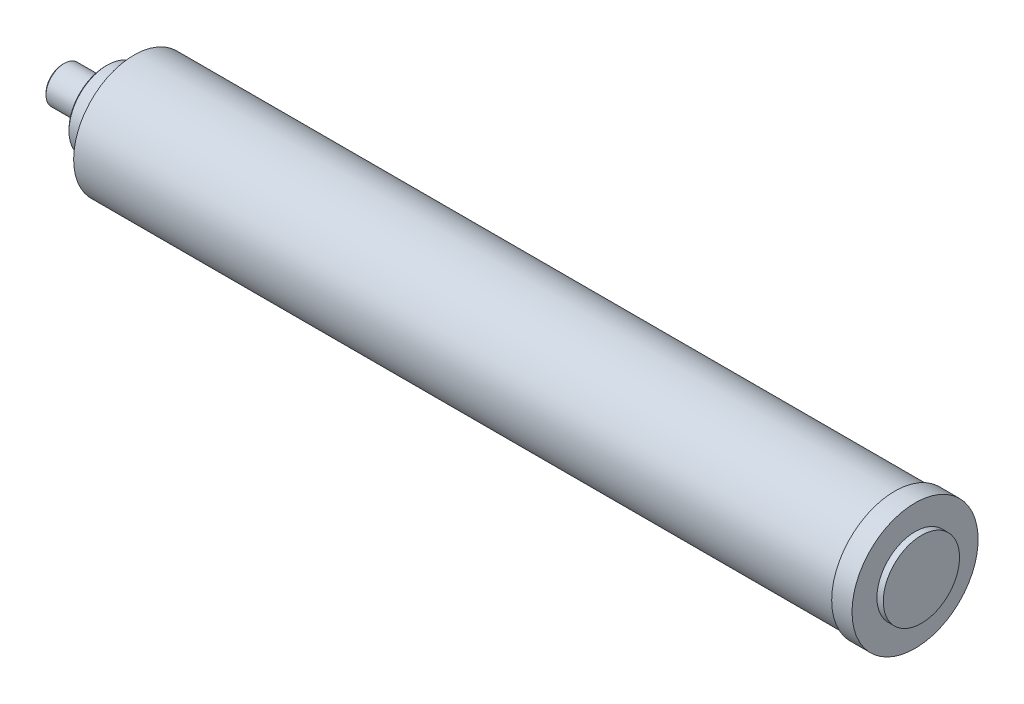
ISO-10303-21;
HEADER;
FILE_DESCRIPTION(('STEP AP214'),'2;1');
FILE_NAME('part.step','',(''),(''),'','','');
FILE_SCHEMA(('AUTOMOTIVE_DESIGN { 1 0 10303 214 1 1 1 1 }'));
ENDSEC;
DATA;
#1=APPLICATION_CONTEXT('core data for automotive mechanical design processes');
#2=APPLICATION_PROTOCOL_DEFINITION('international standard','automotive_design',2000,#1);
#3=PRODUCT_CONTEXT('',#1,'mechanical');
#4=PRODUCT('Part','Part','',(#3));
#5=PRODUCT_RELATED_PRODUCT_CATEGORY('part','',(#4));
#6=PRODUCT_DEFINITION_FORMATION('','',#4);
#7=PRODUCT_DEFINITION_CONTEXT('part definition',#1,'design');
#8=PRODUCT_DEFINITION('design','',#6,#7);
#9=PRODUCT_DEFINITION_SHAPE('','',#8);
#10=(LENGTH_UNIT() NAMED_UNIT(*) SI_UNIT(.MILLI.,.METRE.));
#11=(NAMED_UNIT(*) PLANE_ANGLE_UNIT() SI_UNIT($,.RADIAN.));
#12=(NAMED_UNIT(*) SI_UNIT($,.STERADIAN.) SOLID_ANGLE_UNIT());
#13=UNCERTAINTY_MEASURE_WITH_UNIT(LENGTH_MEASURE(1.E-05),#10,'distance_accuracy_value','');
#14=(GEOMETRIC_REPRESENTATION_CONTEXT(3) GLOBAL_UNCERTAINTY_ASSIGNED_CONTEXT((#13)) GLOBAL_UNIT_ASSIGNED_CONTEXT((#10,
#11,#12)) REPRESENTATION_CONTEXT('',''));
#15=CARTESIAN_POINT('',(0.,0.,0.));
#16=DIRECTION('',(0.,0.,1.));
#17=DIRECTION('',(1.,0.,0.));
#18=AXIS2_PLACEMENT_3D('',#15,#16,#17);
#19=CARTESIAN_POINT('',(0.,0.,0.));
#20=DIRECTION('',(1.,0.,0.));
#21=DIRECTION('',(0.,0.,-1.));
#22=AXIS2_PLACEMENT_3D('',#19,#20,#21);
#23=PLANE('',#22);
#24=CARTESIAN_POINT('',(0.,0.,0.));
#25=DIRECTION('',(1.,0.,0.));
#26=DIRECTION('',(0.,0.,-1.));
#27=AXIS2_PLACEMENT_3D('',#24,#25,#26);
#28=CIRCLE('',#27,10.395);
#29=CARTESIAN_POINT('',(0.,0.,-10.395));
#30=VERTEX_POINT('',#29);
#31=EDGE_CURVE('E52',#30,#30,#28,.F.);
#32=ORIENTED_EDGE('',*,*,#31,.T.);
#33=EDGE_LOOP('',(#32));
#34=FACE_BOUND('',#33,.T.);
#35=ADVANCED_FACE('F45',(#34),#23,.F.);
#36=CARTESIAN_POINT('',(0.,0.,0.));
#37=DIRECTION('',(-1.,0.,0.));
#38=DIRECTION('',(0.,0.,1.));
#39=AXIS2_PLACEMENT_3D('',#36,#37,#38);
#40=CYLINDRICAL_SURFACE('',#39,11.3949999999999);
#41=CARTESIAN_POINT('',(0.999999999999931,0.,0.));
#42=DIRECTION('',(1.,0.,0.));
#43=DIRECTION('',(0.,0.,-1.));
#44=AXIS2_PLACEMENT_3D('',#41,#42,#43);
#45=CIRCLE('',#44,11.3949999999999);
#46=CARTESIAN_POINT('',(0.999999999999931,0.,-11.3949999999999));
#47=VERTEX_POINT('',#46);
#48=EDGE_CURVE('E12',#47,#47,#45,.T.);
#49=ORIENTED_EDGE('',*,*,#48,.T.);
#50=EDGE_LOOP('',(#49));
#51=FACE_BOUND('',#50,.T.);
#52=CARTESIAN_POINT('',(26.75,0.,0.));
#53=DIRECTION('',(-1.,0.,0.));
#54=DIRECTION('',(0.,0.,1.));
#55=AXIS2_PLACEMENT_3D('',#52,#53,#54);
#56=CIRCLE('',#55,11.3949999999999);
#57=CARTESIAN_POINT('',(26.75,0.,11.3949999999999));
#58=VERTEX_POINT('',#57);
#59=EDGE_CURVE('E65',#58,#58,#56,.T.);
#60=ORIENTED_EDGE('',*,*,#59,.T.);
#61=EDGE_LOOP('',(#60));
#62=FACE_BOUND('',#61,.T.);
#63=ADVANCED_FACE('F105',(#51,#62),#40,.T.);
#64=CARTESIAN_POINT('',(26.75,11.3949999999999,0.));
#65=DIRECTION('',(1.,0.,0.));
#66=DIRECTION('',(0.,0.,-1.));
#67=AXIS2_PLACEMENT_3D('',#64,#65,#66);
#68=PLANE('',#67);
#69=CARTESIAN_POINT('',(26.75,0.,0.));
#70=DIRECTION('',(1.,0.,0.));
#71=DIRECTION('',(0.,0.,-1.));
#72=AXIS2_PLACEMENT_3D('',#69,#70,#71);
#73=CIRCLE('',#72,22.8);
#74=CARTESIAN_POINT('',(26.75,0.,-22.8));
#75=VERTEX_POINT('',#74);
#76=EDGE_CURVE('E60',#75,#75,#73,.F.);
#77=ORIENTED_EDGE('',*,*,#76,.T.);
#78=EDGE_LOOP('',(#77));
#79=FACE_BOUND('',#78,.T.);
#80=ORIENTED_EDGE('',*,*,#59,.F.);
#81=EDGE_LOOP('',(#80));
#82=FACE_BOUND('',#81,.T.);
#83=ADVANCED_FACE('F110',(#79,#82),#68,.F.);
#84=CARTESIAN_POINT('',(0.,0.,0.));
#85=DIRECTION('',(-1.,0.,0.));
#86=DIRECTION('',(0.,0.,1.));
#87=AXIS2_PLACEMENT_3D('',#84,#85,#86);
#88=CYLINDRICAL_SURFACE('',#87,23.8);
#89=CARTESIAN_POINT('',(27.75,0.,0.));
#90=DIRECTION('',(1.,0.,0.));
#91=DIRECTION('',(0.,0.,-1.));
#92=AXIS2_PLACEMENT_3D('',#89,#90,#91);
#93=CIRCLE('',#92,23.8);
#94=CARTESIAN_POINT('',(27.75,0.,-23.8));
#95=VERTEX_POINT('',#94);
#96=EDGE_CURVE('E56',#95,#95,#93,.T.);
#97=ORIENTED_EDGE('',*,*,#96,.T.);
#98=EDGE_LOOP('',(#97));
#99=FACE_BOUND('',#98,.T.);
#100=CARTESIAN_POINT('',(44.5,0.,0.));
#101=DIRECTION('',(-1.,0.,0.));
#102=DIRECTION('',(0.,0.,1.));
#103=AXIS2_PLACEMENT_3D('',#100,#101,#102);
#104=CIRCLE('',#103,23.8);
#105=CARTESIAN_POINT('',(44.5,0.,23.8));
#106=VERTEX_POINT('',#105);
#107=EDGE_CURVE('E68',#106,#106,#104,.T.);
#108=ORIENTED_EDGE('',*,*,#107,.T.);
#109=EDGE_LOOP('',(#108));
#110=FACE_BOUND('',#109,.T.);
#111=ADVANCED_FACE('F115',(#99,#110),#88,.T.);
#112=CARTESIAN_POINT('',(44.5,23.8,0.));
#113=DIRECTION('',(1.,0.,0.));
#114=DIRECTION('',(0.,0.,-1.));
#115=AXIS2_PLACEMENT_3D('',#112,#113,#114);
#116=PLANE('',#115);
#117=ORIENTED_EDGE('',*,*,#107,.F.);
#118=EDGE_LOOP('',(#117));
#119=FACE_BOUND('',#118,.T.);
#120=CARTESIAN_POINT('',(44.5,0.,0.));
#121=DIRECTION('',(-1.,0.,0.));
#122=DIRECTION('',(0.,0.,1.));
#123=AXIS2_PLACEMENT_3D('',#120,#121,#122);
#124=CIRCLE('',#123,37.65);
#125=CARTESIAN_POINT('',(44.5,0.,37.65));
#126=VERTEX_POINT('',#125);
#127=EDGE_CURVE('E71',#126,#126,#124,.T.);
#128=ORIENTED_EDGE('',*,*,#127,.T.);
#129=EDGE_LOOP('',(#128));
#130=FACE_BOUND('',#129,.T.);
#131=ADVANCED_FACE('F119',(#119,#130),#116,.F.);
#132=CARTESIAN_POINT('',(0.,0.,0.));
#133=DIRECTION('',(-1.,0.,0.));
#134=DIRECTION('',(0.,0.,1.));
#135=AXIS2_PLACEMENT_3D('',#132,#133,#134);
#136=CYLINDRICAL_SURFACE('',#135,37.65);
#137=ORIENTED_EDGE('',*,*,#127,.F.);
#138=EDGE_LOOP('',(#137));
#139=FACE_BOUND('',#138,.T.);
#140=CARTESIAN_POINT('',(519.3,0.,0.));
#141=DIRECTION('',(-1.,0.,0.));
#142=DIRECTION('',(0.,0.,1.));
#143=AXIS2_PLACEMENT_3D('',#140,#141,#142);
#144=CIRCLE('',#143,37.6499999999999);
#145=CARTESIAN_POINT('',(519.3,0.,37.6499999999999));
#146=VERTEX_POINT('',#145);
#147=EDGE_CURVE('E74',#146,#146,#144,.T.);
#148=ORIENTED_EDGE('',*,*,#147,.T.);
#149=EDGE_LOOP('',(#148));
#150=FACE_BOUND('',#149,.T.);
#151=ADVANCED_FACE('F123',(#139,#150),#136,.T.);
#152=CARTESIAN_POINT('',(519.3,37.6499999999999,0.));
#153=DIRECTION('',(1.,0.,0.));
#154=DIRECTION('',(0.,0.,-1.));
#155=AXIS2_PLACEMENT_3D('',#152,#153,#154);
#156=PLANE('',#155);
#157=ORIENTED_EDGE('',*,*,#147,.F.);
#158=EDGE_LOOP('',(#157));
#159=FACE_BOUND('',#158,.T.);
#160=CARTESIAN_POINT('',(519.3,0.,0.));
#161=DIRECTION('',(-1.,0.,0.));
#162=DIRECTION('',(0.,0.,1.));
#163=AXIS2_PLACEMENT_3D('',#160,#161,#162);
#164=CIRCLE('',#163,39.35);
#165=CARTESIAN_POINT('',(519.3,0.,39.35));
#166=VERTEX_POINT('',#165);
#167=EDGE_CURVE('E77',#166,#166,#164,.T.);
#168=ORIENTED_EDGE('',*,*,#167,.T.);
#169=EDGE_LOOP('',(#168));
#170=FACE_BOUND('',#169,.T.);
#171=ADVANCED_FACE('F127',(#159,#170),#156,.F.);
#172=CARTESIAN_POINT('',(0.,0.,0.));
#173=DIRECTION('',(-1.,0.,0.));
#174=DIRECTION('',(0.,0.,1.));
#175=AXIS2_PLACEMENT_3D('',#172,#173,#174);
#176=CYLINDRICAL_SURFACE('',#175,39.35);
#177=ORIENTED_EDGE('',*,*,#167,.F.);
#178=EDGE_LOOP('',(#177));
#179=FACE_BOUND('',#178,.T.);
#180=CARTESIAN_POINT('',(532.,0.,0.));
#181=DIRECTION('',(-1.,0.,0.));
#182=DIRECTION('',(0.,0.,1.));
#183=AXIS2_PLACEMENT_3D('',#180,#181,#182);
#184=CIRCLE('',#183,39.35);
#185=CARTESIAN_POINT('',(532.,0.,39.35));
#186=VERTEX_POINT('',#185);
#187=EDGE_CURVE('E80',#186,#186,#184,.T.);
#188=ORIENTED_EDGE('',*,*,#187,.T.);
#189=EDGE_LOOP('',(#188));
#190=FACE_BOUND('',#189,.T.);
#191=ADVANCED_FACE('F131',(#179,#190),#176,.T.);
#192=CARTESIAN_POINT('',(532.,39.35,0.));
#193=DIRECTION('',(-1.,0.,0.));
#194=DIRECTION('',(0.,0.,1.));
#195=AXIS2_PLACEMENT_3D('',#192,#193,#194);
#196=PLANE('',#195);
#197=ORIENTED_EDGE('',*,*,#187,.F.);
#198=EDGE_LOOP('',(#197));
#199=FACE_BOUND('',#198,.T.);
#200=CARTESIAN_POINT('',(532.,0.,0.));
#201=DIRECTION('',(-1.,0.,0.));
#202=DIRECTION('',(0.,0.,1.));
#203=AXIS2_PLACEMENT_3D('',#200,#201,#202);
#204=CIRCLE('',#203,23.8);
#205=CARTESIAN_POINT('',(532.,0.,23.8));
#206=VERTEX_POINT('',#205);
#207=EDGE_CURVE('E83',#206,#206,#204,.T.);
#208=ORIENTED_EDGE('',*,*,#207,.T.);
#209=EDGE_LOOP('',(#208));
#210=FACE_BOUND('',#209,.T.);
#211=ADVANCED_FACE('F101',(#199,#210),#196,.F.);
#212=CARTESIAN_POINT('',(0.,0.,0.));
#213=DIRECTION('',(-1.,0.,0.));
#214=DIRECTION('',(0.,0.,1.));
#215=AXIS2_PLACEMENT_3D('',#212,#213,#214);
#216=CYLINDRICAL_SURFACE('',#215,23.8);
#217=ORIENTED_EDGE('',*,*,#207,.F.);
#218=EDGE_LOOP('',(#217));
#219=FACE_BOUND('',#218,.T.);
#220=CARTESIAN_POINT('',(535.96,0.,0.));
#221=DIRECTION('',(-1.,0.,0.));
#222=DIRECTION('',(0.,0.,1.));
#223=AXIS2_PLACEMENT_3D('',#220,#221,#222);
#224=CIRCLE('',#223,23.8);
#225=CARTESIAN_POINT('',(535.96,0.,23.8));
#226=VERTEX_POINT('',#225);
#227=EDGE_CURVE('E86',#226,#226,#224,.T.);
#228=ORIENTED_EDGE('',*,*,#227,.T.);
#229=EDGE_LOOP('',(#228));
#230=FACE_BOUND('',#229,.T.);
#231=ADVANCED_FACE('F90',(#219,#230),#216,.T.);
#232=CARTESIAN_POINT('',(535.96,23.8,0.));
#233=DIRECTION('',(-1.,0.,0.));
#234=DIRECTION('',(0.,0.,1.));
#235=AXIS2_PLACEMENT_3D('',#232,#233,#234);
#236=PLANE('',#235);
#237=ORIENTED_EDGE('',*,*,#227,.F.);
#238=EDGE_LOOP('',(#237));
#239=FACE_BOUND('',#238,.T.);
#240=ADVANCED_FACE('F92',(#239),#236,.F.);
#241=CARTESIAN_POINT('',(26.75,0.,0.));
#242=DIRECTION('',(1.,0.,0.));
#243=DIRECTION('',(0.,0.,-1.));
#244=AXIS2_PLACEMENT_3D('',#241,#242,#243);
#245=CONICAL_SURFACE('',#244,22.8,0.785398163397462);
#246=ORIENTED_EDGE('',*,*,#96,.F.);
#247=EDGE_LOOP('',(#246));
#248=FACE_BOUND('',#247,.T.);
#249=ORIENTED_EDGE('',*,*,#76,.F.);
#250=EDGE_LOOP('',(#249));
#251=FACE_BOUND('',#250,.T.);
#252=ADVANCED_FACE('F94',(#248,#251),#245,.T.);
#253=CARTESIAN_POINT('',(0.,0.,0.));
#254=DIRECTION('',(1.,0.,0.));
#255=DIRECTION('',(0.,0.,-1.));
#256=AXIS2_PLACEMENT_3D('',#253,#254,#255);
#257=CONICAL_SURFACE('',#256,10.395,0.785398163397457);
#258=ORIENTED_EDGE('',*,*,#48,.F.);
#259=EDGE_LOOP('',(#258));
#260=FACE_BOUND('',#259,.T.);
#261=ORIENTED_EDGE('',*,*,#31,.F.);
#262=EDGE_LOOP('',(#261));
#263=FACE_BOUND('',#262,.T.);
#264=ADVANCED_FACE('F47',(#260,#263),#257,.T.);
#265=CLOSED_SHELL('',(#35,#63,#83,#111,#131,#151,#171,#191,#211,#231,#240,#252,#264));
#266=MANIFOLD_SOLID_BREP('B2',#265);
#267=ADVANCED_BREP_SHAPE_REPRESENTATION('',(#18,#266),#14);
#268=SHAPE_DEFINITION_REPRESENTATION(#9,#267);
ENDSEC;
END-ISO-10303-21;
